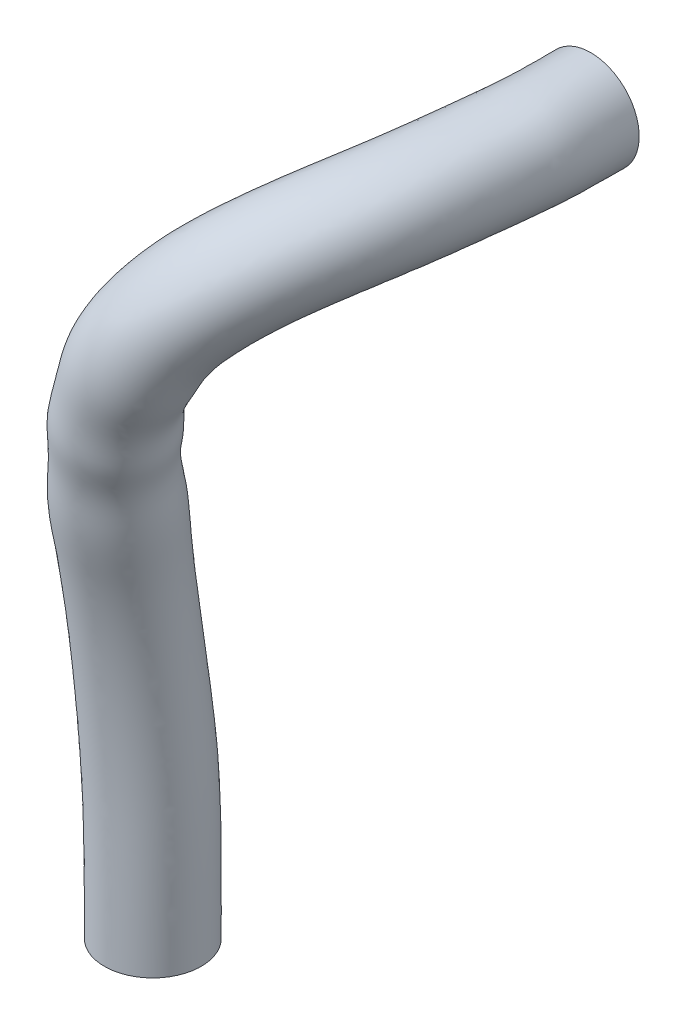
ISO-10303-21;
HEADER;
FILE_DESCRIPTION(('STEP AP214'),'2;1');
FILE_NAME('part.step','',(''),(''),'','','');
FILE_SCHEMA(('AUTOMOTIVE_DESIGN { 1 0 10303 214 1 1 1 1 }'));
ENDSEC;
DATA;
#1=APPLICATION_CONTEXT('core data for automotive mechanical design processes');
#2=APPLICATION_PROTOCOL_DEFINITION('international standard','automotive_design',2000,#1);
#3=PRODUCT_CONTEXT('',#1,'mechanical');
#4=PRODUCT('Part','Part','',(#3));
#5=PRODUCT_RELATED_PRODUCT_CATEGORY('part','',(#4));
#6=PRODUCT_DEFINITION_FORMATION('','',#4);
#7=PRODUCT_DEFINITION_CONTEXT('part definition',#1,'design');
#8=PRODUCT_DEFINITION('design','',#6,#7);
#9=PRODUCT_DEFINITION_SHAPE('','',#8);
#10=(LENGTH_UNIT() NAMED_UNIT(*) SI_UNIT(.MILLI.,.METRE.));
#11=(NAMED_UNIT(*) PLANE_ANGLE_UNIT() SI_UNIT($,.RADIAN.));
#12=(NAMED_UNIT(*) SI_UNIT($,.STERADIAN.) SOLID_ANGLE_UNIT());
#13=UNCERTAINTY_MEASURE_WITH_UNIT(LENGTH_MEASURE(1.E-05),#10,'distance_accuracy_value','');
#14=(GEOMETRIC_REPRESENTATION_CONTEXT(3) GLOBAL_UNCERTAINTY_ASSIGNED_CONTEXT((#13)) GLOBAL_UNIT_ASSIGNED_CONTEXT((#10,
#11,#12)) REPRESENTATION_CONTEXT('',''));
#15=CARTESIAN_POINT('',(0.,0.,0.));
#16=DIRECTION('',(0.,0.,1.));
#17=DIRECTION('',(1.,0.,0.));
#18=AXIS2_PLACEMENT_3D('',#15,#16,#17);
#19=CARTESIAN_POINT('',(-336.55,927.1,338.85632));
#20=DIRECTION('',(0.,0.,1.));
#21=DIRECTION('',(0.,-1.,0.));
#22=AXIS2_PLACEMENT_3D('',#19,#20,#21);
#23=PLANE('',#22);
#24=CARTESIAN_POINT('',(-336.55,927.1,338.85632));
#25=DIRECTION('',(0.,0.,1.));
#26=DIRECTION('',(-0.546944138603988,0.837169104331223,0.));
#27=AXIS2_PLACEMENT_3D('',#24,#25,#26);
#28=CIRCLE('',#27,9.525);
#29=CARTESIAN_POINT('',(-341.759642920203,935.074035718755,338.85632));
#30=VERTEX_POINT('',#29);
#31=EDGE_CURVE('E116',#30,#30,#28,.T.);
#32=ORIENTED_EDGE('',*,*,#31,.F.);
#33=EDGE_LOOP('',(#32));
#34=FACE_BOUND('',#33,.T.);
#35=ADVANCED_FACE('F108',(#34),#23,.F.);
#36=CARTESIAN_POINT('',(-370.740939999992,794.575500000011,390.834879999985));
#37=DIRECTION('',(0.,1.,0.));
#38=DIRECTION('',(-1.,0.,0.));
#39=AXIS2_PLACEMENT_3D('',#36,#37,#38);
#40=PLANE('',#39);
#41=CARTESIAN_POINT('',(-370.740939999992,794.575500000011,390.834879999985));
#42=DIRECTION('',(0.,1.,0.));
#43=DIRECTION('',(-1.,0.,0.));
#44=AXIS2_PLACEMENT_3D('',#41,#42,#43);
#45=CIRCLE('',#44,9.52499999999996);
#46=CARTESIAN_POINT('',(-380.265939999992,794.575500000011,390.834879999985));
#47=VERTEX_POINT('',#46);
#48=EDGE_CURVE('E12',#47,#47,#45,.T.);
#49=ORIENTED_EDGE('',*,*,#48,.F.);
#50=EDGE_LOOP('',(#49));
#51=FACE_BOUND('',#50,.T.);
#52=ADVANCED_FACE('F158',(#51),#40,.F.);
#53=CARTESIAN_POINT('',(-363.875846561977,794.575500000011,384.232144423929));
#54=CARTESIAN_POINT('',(-363.875846561977,813.494487125589,384.232144423929));
#55=CARTESIAN_POINT('',(-364.142477812169,826.543072637404,383.884203964754));
#56=CARTESIAN_POINT('',(-365.43892785685,858.15359636656,388.398999546555));
#57=CARTESIAN_POINT('',(-362.228331439262,877.176558179828,393.33315585329));
#58=CARTESIAN_POINT('',(-360.825178694179,883.772837052275,406.918336997418));
#59=CARTESIAN_POINT('',(-370.168532993468,896.388842718701,410.098146877855));
#60=CARTESIAN_POINT('',(-364.791534219286,910.423752705118,406.962201341084));
#61=CARTESIAN_POINT('',(-359.005182071554,919.28936800987,401.644646519413));
#62=CARTESIAN_POINT('',(-353.04268762069,925.381572620677,394.639029982038));
#63=CARTESIAN_POINT('',(-346.394330440372,930.611193828081,384.623236621365));
#64=CARTESIAN_POINT('',(-340.169241583707,934.259595968167,372.17092812119));
#65=CARTESIAN_POINT('',(-336.141143205497,936.242700496443,352.923508258373));
#66=CARTESIAN_POINT('',(-335.539936275564,936.571293273496,349.235045549637));
#67=CARTESIAN_POINT('',(-335.539936275564,936.571293273496,338.85632));
#68=CARTESIAN_POINT('',(-364.058054005525,794.575500000011,384.04269701828));
#69=CARTESIAN_POINT('',(-364.058054005525,813.494962976376,384.04269701828));
#70=CARTESIAN_POINT('',(-364.321338442818,826.53140731676,383.682490368678));
#71=CARTESIAN_POINT('',(-365.589978433164,858.187764176544,388.20393458159));
#72=CARTESIAN_POINT('',(-362.346753878444,877.237841983857,393.081553072442));
#73=CARTESIAN_POINT('',(-360.599604240086,883.766624345786,406.653348799992));
#74=CARTESIAN_POINT('',(-369.913851290476,896.285905434293,410.156313388854));
#75=CARTESIAN_POINT('',(-364.574253435235,910.319256297719,407.060664458551));
#76=CARTESIAN_POINT('',(-358.792066401507,919.194740795188,401.76818132861));
#77=CARTESIAN_POINT('',(-352.825506024652,925.303059391486,394.764503223676));
#78=CARTESIAN_POINT('',(-346.165193021624,930.550619958902,384.738159427502));
#79=CARTESIAN_POINT('',(-339.922656909605,934.216511465068,372.257669482981));
#80=CARTESIAN_POINT('',(-335.88169340562,936.210137222335,352.955324071846));
#81=CARTESIAN_POINT('',(-335.278568829513,936.543419806972,349.259881184934));
#82=CARTESIAN_POINT('',(-335.278568829513,936.543419806972,338.85632));
#83=CARTESIAN_POINT('',(-364.434421808419,794.575500000011,383.682159154449));
#84=CARTESIAN_POINT('',(-364.434421808419,813.495348407488,383.682159154449));
#85=CARTESIAN_POINT('',(-364.691939348121,826.507838651346,383.297512257145));
#86=CARTESIAN_POINT('',(-365.905327975946,858.252268481178,387.829305405729));
#87=CARTESIAN_POINT('',(-362.602308173534,877.35946015612,392.592971113257));
#88=CARTESIAN_POINT('',(-360.17338657529,883.761932398954,406.110756254147));
#89=CARTESIAN_POINT('',(-369.403969957824,896.081619830949,410.249099232851));
#90=CARTESIAN_POINT('',(-364.139567488344,910.102780991475,407.23676024951));
#91=CARTESIAN_POINT('',(-358.367592897617,918.992242749762,401.997492628252));
#92=CARTESIAN_POINT('',(-352.394985669194,925.12958483654,395.001282678477));
#93=CARTESIAN_POINT('',(-345.712601038936,930.410733848442,384.957782805191));
#94=CARTESIAN_POINT('',(-339.436382819251,934.110363419539,372.424832973385));
#95=CARTESIAN_POINT('',(-335.370201989204,936.124465452419,353.016664328773));
#96=CARTESIAN_POINT('',(-334.763013932223,936.466977526842,349.308313868497));
#97=CARTESIAN_POINT('',(-334.763013932223,936.466977526842,338.85632));
#98=CARTESIAN_POINT('',(-365.03135498484,794.575500000011,383.196490939595));
#99=CARTESIAN_POINT('',(-365.03135498484,813.494260247922,383.196490939595));
#100=CARTESIAN_POINT('',(-365.282934134063,826.471946571246,382.775590815188));
#101=CARTESIAN_POINT('',(-366.414829950331,858.337577711828,387.314325523003));
#102=CARTESIAN_POINT('',(-363.038247029484,877.538442477659,391.905183264417));
#103=CARTESIAN_POINT('',(-359.608580246851,883.777275192592,405.263526602564));
#104=CARTESIAN_POINT('',(-368.640588870671,895.780961486469,410.319679983601));
#105=CARTESIAN_POINT('',(-363.489683754225,909.757687092094,407.439677985908));
#106=CARTESIAN_POINT('',(-357.738409562969,918.651381559457,402.288809159446));
#107=CARTESIAN_POINT('',(-351.762793635226,924.822829029902,395.314131189466));
#108=CARTESIAN_POINT('',(-345.052747352562,930.147547081319,385.2564357266));
#109=CARTESIAN_POINT('',(-338.729704526453,933.894003174015,372.656130803312));
#110=CARTESIAN_POINT('',(-334.627325633567,935.93706507243,353.102498629935));
#111=CARTESIAN_POINT('',(-334.01340618597,936.292934259841,349.375379379043));
#112=CARTESIAN_POINT('',(-334.01340618597,936.292934259841,338.85632));
#113=CARTESIAN_POINT('',(-365.657192358033,794.575500000011,382.766029044133));
#114=CARTESIAN_POINT('',(-365.657192358033,813.491556815287,382.766029044133));
#115=CARTESIAN_POINT('',(-365.905476843968,826.435681480846,382.309413576269));
#116=CARTESIAN_POINT('',(-366.957542074675,858.411487150723,386.846771154726));
#117=CARTESIAN_POINT('',(-363.523272461877,877.713383095033,391.263694769784));
#118=CARTESIAN_POINT('',(-359.118020525756,883.814179056576,404.387463829391));
#119=CARTESIAN_POINT('',(-367.881643387165,895.487076360433,410.32370595832));
#120=CARTESIAN_POINT('',(-362.844463528909,909.394278788281,407.582635739603));
#121=CARTESIAN_POINT('',(-357.119006562084,918.276022972674,402.528097644739));
#122=CARTESIAN_POINT('',(-351.14625008985,924.472329564608,395.584847524689));
#123=CARTESIAN_POINT('',(-344.413913677084,929.833860227586,385.524151041061));
#124=CARTESIAN_POINT('',(-338.047806145576,933.623303692037,372.867774088236));
#125=CARTESIAN_POINT('',(-333.910946265888,935.693514907318,353.181818663902));
#126=CARTESIAN_POINT('',(-333.289707654644,936.062217340463,349.437225296379));
#127=CARTESIAN_POINT('',(-333.289707654644,936.062217340463,338.85632));
#128=CARTESIAN_POINT('',(-369.564778125985,794.575500000011,380.514902018702));
#129=CARTESIAN_POINT('',(-369.564778125985,813.466405433784,380.514902018702));
#130=CARTESIAN_POINT('',(-369.808747623031,826.216630452866,379.848006234895));
#131=CARTESIAN_POINT('',(-370.393470658995,858.78684718221,384.328767812612));
#132=CARTESIAN_POINT('',(-366.706819493678,878.735192588011,387.699845537147));
#133=CARTESIAN_POINT('',(-356.618500474763,884.160051807726,398.985134606121));
#134=CARTESIAN_POINT('',(-363.37255225895,893.770423709888,409.960792960402));
#135=CARTESIAN_POINT('',(-359.016233165324,907.116341783373,408.088217384858));
#136=CARTESIAN_POINT('',(-353.474791034827,915.832587419012,403.655397417965));
#137=CARTESIAN_POINT('',(-347.553239685383,922.123672716435,396.957472622514));
#138=CARTESIAN_POINT('',(-340.718946029013,927.665883673389,386.943938156198));
#139=CARTESIAN_POINT('',(-334.11737774697,931.689865026476,374.018084956403));
#140=CARTESIAN_POINT('',(-329.784469301397,933.911772845741,353.618013038122));
#141=CARTESIAN_POINT('',(-329.116079447723,934.354111076519,349.776175568566));
#142=CARTESIAN_POINT('',(-329.116079447723,934.354111076519,338.85632));
#143=CARTESIAN_POINT('',(-374.312517085676,794.575500000011,381.054467465187));
#144=CARTESIAN_POINT('',(-374.312517085676,813.361599723884,381.054467465187));
#145=CARTESIAN_POINT('',(-374.673178142008,826.011711079975,380.227476364194));
#146=CARTESIAN_POINT('',(-374.923366390826,858.596518397306,384.279452786801));
#147=CARTESIAN_POINT('',(-371.738665615061,879.44813163321,386.6810480973));
#148=CARTESIAN_POINT('',(-357.807701153077,885.446257225217,392.928379849387));
#149=CARTESIAN_POINT('',(-359.616103081324,892.572024288783,406.609159576154));
#150=CARTESIAN_POINT('',(-355.867906349279,904.281888724747,405.799577914562));
#151=CARTESIAN_POINT('',(-350.721196746988,912.115351743268,402.274064789705));
#152=CARTESIAN_POINT('',(-345.112022146781,918.068274272769,396.242417373719));
#153=CARTESIAN_POINT('',(-338.433009558086,923.461203370457,386.78077700164));
#154=CARTESIAN_POINT('',(-331.796073237616,927.516131019332,374.13031230384));
#155=CARTESIAN_POINT('',(-327.369301738105,929.788705025014,353.711235453028));
#156=CARTESIAN_POINT('',(-326.632731262108,930.271815412385,349.820479424925));
#157=CARTESIAN_POINT('',(-326.632731262108,930.271815412385,338.85632));
#158=CARTESIAN_POINT('',(-381.132623689013,794.575500000011,387.613935432948));
#159=CARTESIAN_POINT('',(-381.132623689013,813.131577020057,387.613935432948));
#160=CARTESIAN_POINT('',(-381.876294869343,825.800622995147,386.725475047013));
#161=CARTESIAN_POINT('',(-382.058003446125,857.183324692249,389.525567993976));
#162=CARTESIAN_POINT('',(-381.022644981808,879.538229951214,391.066587411424));
#163=CARTESIAN_POINT('',(-366.980968655411,888.823635217389,385.123625870285));
#164=CARTESIAN_POINT('',(-357.261914948152,892.417903398694,396.653135207719));
#165=CARTESIAN_POINT('',(-354.000219597394,900.092312222862,397.384284986249));
#166=CARTESIAN_POINT('',(-349.722864876701,905.453509410003,395.430380030142));
#167=CARTESIAN_POINT('',(-345.004301546448,910.119926026257,391.006515395318));
#168=CARTESIAN_POINT('',(-339.041453714237,914.64695165494,383.209975120029));
#169=CARTESIAN_POINT('',(-332.796576672215,918.29763848496,372.028838732515));
#170=CARTESIAN_POINT('',(-328.489926478525,920.406923498248,353.044922210753));
#171=CARTESIAN_POINT('',(-327.636176056998,920.862587354538,349.2968446959));
#172=CARTESIAN_POINT('',(-327.636176056998,920.862587354538,338.85632));
#173=CARTESIAN_POINT('',(-381.250182308986,794.575500000011,393.648667463076));
#174=CARTESIAN_POINT('',(-381.250182308986,812.998174684243,393.648667463076));
#175=CARTESIAN_POINT('',(-382.220950377274,825.905383354459,392.931653957796));
#176=CARTESIAN_POINT('',(-382.823336579002,855.990272367354,395.059138931047));
#177=CARTESIAN_POINT('',(-383.287217055104,878.583937547873,397.130035530821));
#178=CARTESIAN_POINT('',(-374.781242158967,890.447800046798,385.906097447789));
#179=CARTESIAN_POINT('',(-360.335465242944,894.019836356626,391.21809694673));
#180=CARTESIAN_POINT('',(-356.685905737772,899.899398007129,391.989833458713));
#181=CARTESIAN_POINT('',(-352.73303452277,903.985254040344,390.337785921258));
#182=CARTESIAN_POINT('',(-348.48219340453,907.80975344087,386.607252991341));
#183=CARTESIAN_POINT('',(-343.036497224882,911.654931859011,379.734782527574));
#184=CARTESIAN_POINT('',(-337.251754026326,914.839306634214,369.662368330795));
#185=CARTESIAN_POINT('',(-333.208180434233,916.704103625166,352.265040339124));
#186=CARTESIAN_POINT('',(-332.332714803409,917.071237396009,348.577148554679));
#187=CARTESIAN_POINT('',(-332.332714803409,917.071237396009,338.85632));
#188=CARTESIAN_POINT('',(-373.961884567028,794.575500000011,401.226563689006));
#189=CARTESIAN_POINT('',(-373.961884567028,812.981060168414,401.226563689006));
#190=CARTESIAN_POINT('',(-375.066525151303,826.371072194808,401.00019754034));
#191=CARTESIAN_POINT('',(-376.781313526436,854.623634026356,402.861738183335));
#192=CARTESIAN_POINT('',(-378.550319487853,876.132571106372,407.194145948691));
#193=CARTESIAN_POINT('',(-383.804220322682,890.696312555326,396.505629441342));
#194=CARTESIAN_POINT('',(-370.52273336266,898.1373270894,388.891423930349));
#195=CARTESIAN_POINT('',(-365.377137099817,904.079254434146,388.051335099304));
#196=CARTESIAN_POINT('',(-361.257661324647,907.77034259295,385.396296124458));
#197=CARTESIAN_POINT('',(-357.16945724602,910.95028261761,381.588686893382));
#198=CARTESIAN_POINT('',(-352.201993974785,914.077886621573,375.136069798063));
#199=CARTESIAN_POINT('',(-347.115140990379,916.562686759692,366.20542628566));
#200=CARTESIAN_POINT('',(-343.586172429312,918.006634589025,350.945789701563));
#201=CARTESIAN_POINT('',(-342.787412645462,918.186176056998,347.684124199891));
#202=CARTESIAN_POINT('',(-342.787412645462,918.186176056998,338.85632));
#203=CARTESIAN_POINT('',(-367.927152536901,794.575500000011,401.344122308979));
#204=CARTESIAN_POINT('',(-367.927152536901,813.097347988399,401.344122308979));
#205=CARTESIAN_POINT('',(-368.913383737486,826.645941958676,401.344653141586));
#206=CARTESIAN_POINT('',(-371.110623969332,854.707025123831,403.662887161426));
#207=CARTESIAN_POINT('',(-372.439987358653,875.096688812927,409.301480448518));
#208=CARTESIAN_POINT('',(-383.32946072663,889.273901237638,404.328626676094));
#209=CARTESIAN_POINT('',(-375.719952755704,899.878275475063,392.437519832297));
#210=CARTESIAN_POINT('',(-369.747628538592,907.665681728195,390.248181395111));
#211=CARTESIAN_POINT('',(-365.168407484909,912.311609872306,386.477190263519));
#212=CARTESIAN_POINT('',(-360.744521843591,915.810166573884,381.912901757532));
#213=CARTESIAN_POINT('',(-355.648171388358,919.037038395228,374.880703660602));
#214=CARTESIAN_POINT('',(-350.667782902732,921.420184697843,365.744026383751));
#215=CARTESIAN_POINT('',(-347.29353175921,922.766944408793,350.732613785325));
#216=CARTESIAN_POINT('',(-346.578762603991,922.882714803409,347.510795986323));
#217=CARTESIAN_POINT('',(-346.578762603991,922.882714803409,338.85632));
#218=CARTESIAN_POINT('',(-361.107045933563,794.575500000011,394.784654341217));
#219=CARTESIAN_POINT('',(-361.107045933563,813.326555347465,394.784654341217));
#220=CARTESIAN_POINT('',(-361.710267010152,826.857422520991,394.846654569562));
#221=CARTESIAN_POINT('',(-363.975986914033,856.12018737142,398.416771676237));
#222=CARTESIAN_POINT('',(-363.156007991905,875.006596560724,404.915941481461));
#223=CARTESIAN_POINT('',(-374.156193224297,885.896521440652,412.133378912942));
#224=CARTESIAN_POINT('',(-378.074140888877,900.032396638516,402.393549549487));
#225=CARTESIAN_POINT('',(-371.615315290477,911.85525817441,398.663463121345));
#226=CARTESIAN_POINT('',(-366.166739355197,918.973452220299,393.320916459618));
#227=CARTESIAN_POINT('',(-360.852242443924,923.758514816527,387.148649110618));
#228=CARTESIAN_POINT('',(-355.039727232208,927.851290112703,378.452271288253));
#229=CARTESIAN_POINT('',(-349.667279468133,930.638677231568,367.840093358808));
#230=CARTESIAN_POINT('',(-346.17290701879,932.148725935744,351.418753709667));
#231=CARTESIAN_POINT('',(-345.575317809101,932.291942861257,347.991730135602));
#232=CARTESIAN_POINT('',(-345.575317809101,932.291942861257,338.85632));
#233=CARTESIAN_POINT('',(-360.382984892778,794.575500000011,390.061531252664));
#234=CARTESIAN_POINT('',(-360.382984892778,813.442305885082,390.061531252664));
#235=CARTESIAN_POINT('',(-360.795606907177,826.804527015982,390.012753066261));
#236=CARTESIAN_POINT('',(-362.781733550676,857.065059052122,394.158476923425));
#237=CARTESIAN_POINT('',(-360.739278708538,875.64698146527,400.378607035243));
#238=CARTESIAN_POINT('',(-367.98564308888,884.4731221011,412.338413396426));
#239=CARTESIAN_POINT('',(-376.206466678774,898.957636978338,407.029668284324));
#240=CARTESIAN_POINT('',(-369.965441352698,912.382122292462,403.126464627447));
#241=CARTESIAN_POINT('',(-364.21411089473,920.601039809969,397.430240288413));
#242=CARTESIAN_POINT('',(-358.497449592682,926.080109524701,390.634605254979));
#243=CARTESIAN_POINT('',(-352.265633474665,930.718320672445,381.152863263289));
#244=CARTESIAN_POINT('',(-346.543266876292,933.860978298727,369.646222211012));
#245=CARTESIAN_POINT('',(-342.858657547869,935.552700592882,352.017663270267));
#246=CARTESIAN_POINT('',(-342.286901675357,935.758710149631,348.518387347715));
#247=CARTESIAN_POINT('',(-342.286901675357,935.758710149631,338.85632));
#248=CARTESIAN_POINT('',(-362.480219602954,794.575500000011,386.06923792815));
#249=CARTESIAN_POINT('',(-362.480219602954,813.483214072288,386.06923792815));
#250=CARTESIAN_POINT('',(-362.786859187844,826.639100298827,385.82649601654));
#251=CARTESIAN_POINT('',(-364.32382110125,857.815734742003,390.247927903653));
#252=CARTESIAN_POINT('',(-361.458456362485,876.644837760915,395.650646081014));
#253=CARTESIAN_POINT('',(-363.05114137382,883.922503834068,409.00780342413));
#254=CARTESIAN_POINT('',(-372.322278829198,897.281892996218,409.309513768366));
#255=CARTESIAN_POINT('',(-366.632975774552,911.216280306298,405.865830160071));
#256=CARTESIAN_POINT('',(-360.834895793786,919.925945046268,400.374144473301));
#257=CARTESIAN_POINT('',(-354.933032891232,925.841287852779,393.397084840518));
#258=CARTESIAN_POINT('',(-348.409158450575,930.890027463809,383.52039743952));
#259=CARTESIAN_POINT('',(-342.34726162435,934.37452597933,371.35504755035));
#260=CARTESIAN_POINT('',(-338.43471834383,936.261288828307,352.628186272256));
#261=CARTESIAN_POINT('',(-337.846915850952,936.548219679412,349.001802652124));
#262=CARTESIAN_POINT('',(-337.846915850952,936.548219679412,338.85632));
#263=CARTESIAN_POINT('',(-362.885981118186,794.575500000011,385.427110640233));
#264=CARTESIAN_POINT('',(-362.885981118186,813.488627595127,385.427110640233));
#265=CARTESIAN_POINT('',(-363.176966807513,826.609312471468,385.150636915818));
#266=CARTESIAN_POINT('',(-364.636307884187,857.93527287277,389.611088312375));
#267=CARTESIAN_POINT('',(-361.643900007779,876.81686585801,394.867642001555));
#268=CARTESIAN_POINT('',(-362.264572391682,883.850425695427,408.383589817813));
#269=CARTESIAN_POINT('',(-371.639299896267,896.992980915504,409.63480743026));
#270=CARTESIAN_POINT('',(-366.048023340962,910.988064165913,406.280338557741));
#271=CARTESIAN_POINT('',(-360.247707647546,919.765555325343,400.834268823368));
#272=CARTESIAN_POINT('',(-354.31996534776,925.747271120664,393.836759931258));
#273=CARTESIAN_POINT('',(-347.750691083502,930.860764902837,383.903322503663));
#274=CARTESIAN_POINT('',(-341.633078315309,934.401295111169,371.634610817676));
#275=CARTESIAN_POINT('',(-337.682177891648,936.320476397034,352.728610581395));
#276=CARTESIAN_POINT('',(-337.090837477639,936.621126157441,349.081400105271));
#277=CARTESIAN_POINT('',(-337.090837477639,936.621126157441,338.85632));
#278=CARTESIAN_POINT('',(-363.348032768784,794.575500000011,384.811715560459));
#279=CARTESIAN_POINT('',(-363.348032768784,813.492493302771,384.811715560459));
#280=CARTESIAN_POINT('',(-363.625505260826,826.577400281625,384.50020428825));
#281=CARTESIAN_POINT('',(-365.004707851203,858.048546506841,388.992355798833));
#282=CARTESIAN_POINT('',(-361.896229226003,876.994063290669,394.093121159352));
#283=CARTESIAN_POINT('',(-361.518345978566,883.798974842905,407.690715122794));
#284=CARTESIAN_POINT('',(-370.922477683622,896.695370490453,409.902288820144));
#285=CARTESIAN_POINT('',(-365.435076923737,910.725827719126,406.649686010351));
#286=CARTESIAN_POINT('',(-359.638268362921,919.556445654639,401.260932722207));
#287=CARTESIAN_POINT('',(-353.689903708488,925.597710122656,394.253160821441));
#288=CARTESIAN_POINT('',(-347.078804172293,930.771897949594,384.272586738367));
#289=CARTESIAN_POINT('',(-340.906613025371,934.367249367941,371.90753016135));
#290=CARTESIAN_POINT('',(-336.917138894918,936.318619891977,352.827400412182));
#291=CARTESIAN_POINT('',(-336.321384562845,936.633169576625,349.159300056714));
#292=CARTESIAN_POINT('',(-336.321384562845,936.633169576625,338.85632));
#293=CARTESIAN_POINT('',(-363.693639118428,794.575500000011,384.421591829577));
#294=CARTESIAN_POINT('',(-363.693639118428,813.494011274803,384.421591829577));
#295=CARTESIAN_POINT('',(-363.96361718152,826.554737958049,384.085917560831));
#296=CARTESIAN_POINT('',(-365.287877280536,858.119428556576,388.59406451152));
#297=CARTESIAN_POINT('',(-362.109909000081,877.115274375799,393.584758634138));
#298=CARTESIAN_POINT('',(-361.050753148272,883.779049758764,407.183325194843));
#299=CARTESIAN_POINT('',(-370.423214696461,896.49178000311,410.039980366856));
#300=CARTESIAN_POINT('',(-365.008815003337,910.528249112517,406.863738223618));
#301=CARTESIAN_POINT('',(-359.218297741601,919.383995224552,401.521111710216));
#302=CARTESIAN_POINT('',(-353.259869216727,925.460085849868,394.5135567404));
#303=CARTESIAN_POINT('',(-346.623467859119,930.67176769726,384.508313815228));
#304=CARTESIAN_POINT('',(-340.415826257808,934.302680471265,372.0841867594));
#305=CARTESIAN_POINT('',(-336.400593005374,936.275263770551,352.8916924449));
#306=CARTESIAN_POINT('',(-335.801303721616,936.599166740021,349.21020991434));
#307=CARTESIAN_POINT('',(-335.801303721616,936.599166740021,338.85632));
#308=CARTESIAN_POINT('',(-363.875846561977,794.575500000011,384.232144423929));
#309=CARTESIAN_POINT('',(-363.875846561977,813.494487125589,384.232144423929));
#310=CARTESIAN_POINT('',(-364.142477812169,826.543072637404,383.884203964754));
#311=CARTESIAN_POINT('',(-365.43892785685,858.15359636656,388.398999546555));
#312=CARTESIAN_POINT('',(-362.228331439262,877.176558179828,393.33315585329));
#313=CARTESIAN_POINT('',(-360.825178694179,883.772837052275,406.918336997418));
#314=CARTESIAN_POINT('',(-370.168532993468,896.388842718701,410.098146877855));
#315=CARTESIAN_POINT('',(-364.791534219286,910.423752705118,406.962201341084));
#316=CARTESIAN_POINT('',(-359.005182071554,919.28936800987,401.644646519413));
#317=CARTESIAN_POINT('',(-353.04268762069,925.381572620677,394.639029982038));
#318=CARTESIAN_POINT('',(-346.394330440372,930.611193828081,384.623236621365));
#319=CARTESIAN_POINT('',(-340.169241583707,934.259595968167,372.17092812119));
#320=CARTESIAN_POINT('',(-336.141143205497,936.242700496443,352.923508258373));
#321=CARTESIAN_POINT('',(-335.539936275564,936.571293273496,349.235045549637));
#322=CARTESIAN_POINT('',(-335.539936275564,936.571293273496,338.85632));
#323=B_SPLINE_SURFACE_WITH_KNOTS('',3,3,((#53,#54,#55,#56,#57,#58,#59,#60,#61,#62,#63,#64,#65,
#66,#67),(#68,#69,#70,#71,#72,#73,#74,#75,#76,#77,#78,#79,#80,#81,#82),(#83,#84,#85,#86,#87,#88,
#89,#90,#91,#92,#93,#94,#95,#96,#97),(#98,#99,#100,#101,#102,#103,#104,#105,#106,#107,#108,#109,
#110,#111,#112),(#113,#114,#115,#116,#117,#118,#119,#120,#121,#122,#123,#124,#125,#126,#127),
(#128,#129,#130,#131,#132,#133,#134,#135,#136,#137,#138,#139,#140,#141,#142),(#143,#144,#145,
#146,#147,#148,#149,#150,#151,#152,#153,#154,#155,#156,#157),(#158,#159,#160,#161,#162,#163,
#164,#165,#166,#167,#168,#169,#170,#171,#172),(#173,#174,#175,#176,#177,#178,#179,#180,#181,
#182,#183,#184,#185,#186,#187),(#188,#189,#190,#191,#192,#193,#194,#195,#196,#197,#198,#199,
#200,#201,#202),(#203,#204,#205,#206,#207,#208,#209,#210,#211,#212,#213,#214,#215,#216,#217),
(#218,#219,#220,#221,#222,#223,#224,#225,#226,#227,#228,#229,#230,#231,#232),(#233,#234,#235,
#236,#237,#238,#239,#240,#241,#242,#243,#244,#245,#246,#247),(#248,#249,#250,#251,#252,#253,
#254,#255,#256,#257,#258,#259,#260,#261,#262),(#263,#264,#265,#266,#267,#268,#269,#270,#271,
#272,#273,#274,#275,#276,#277),(#278,#279,#280,#281,#282,#283,#284,#285,#286,#287,#288,#289,
#290,#291,#292),(#293,#294,#295,#296,#297,#298,#299,#300,#301,#302,#303,#304,#305,#306,#307),
(#308,#309,#310,#311,#312,#313,#314,#315,#316,#317,#318,#319,#320,#321,#322)),.UNSPECIFIED.,.T.,
.F.,.F.,(4,1,1,1,1,2,2,2,1,1,1,1,4),(4,1,1,1,1,1,1,1,1,1,1,1,4),(0.,0.0125,0.0249999999999999,
0.0375000000000001,0.05,0.25,0.5,0.75,0.95,0.9625,0.975,0.9875,1.),(0.,0.180740314038915,
0.361426285290838,0.422863687724523,0.50038728112685,0.577629025770167,0.623899099093263,
0.669151315843759,0.714326155940481,0.759484959211556,0.839608910317355,0.91976256033915,1.),.UNSPECIFIED.);
#324=ORIENTED_EDGE('',*,*,#48,.T.);
#325=EDGE_LOOP('',(#324));
#326=FACE_BOUND('',#325,.T.);
#327=ORIENTED_EDGE('',*,*,#31,.T.);
#328=EDGE_LOOP('',(#327));
#329=FACE_BOUND('',#328,.T.);
#330=ADVANCED_FACE('F142',(#326,#329),#323,.T.);
#331=CLOSED_SHELL('',(#35,#52,#330));
#332=MANIFOLD_SOLID_BREP('B2',#331);
#333=ADVANCED_BREP_SHAPE_REPRESENTATION('',(#18,#332),#14);
#334=SHAPE_DEFINITION_REPRESENTATION(#9,#333);
ENDSEC;
END-ISO-10303-21;
